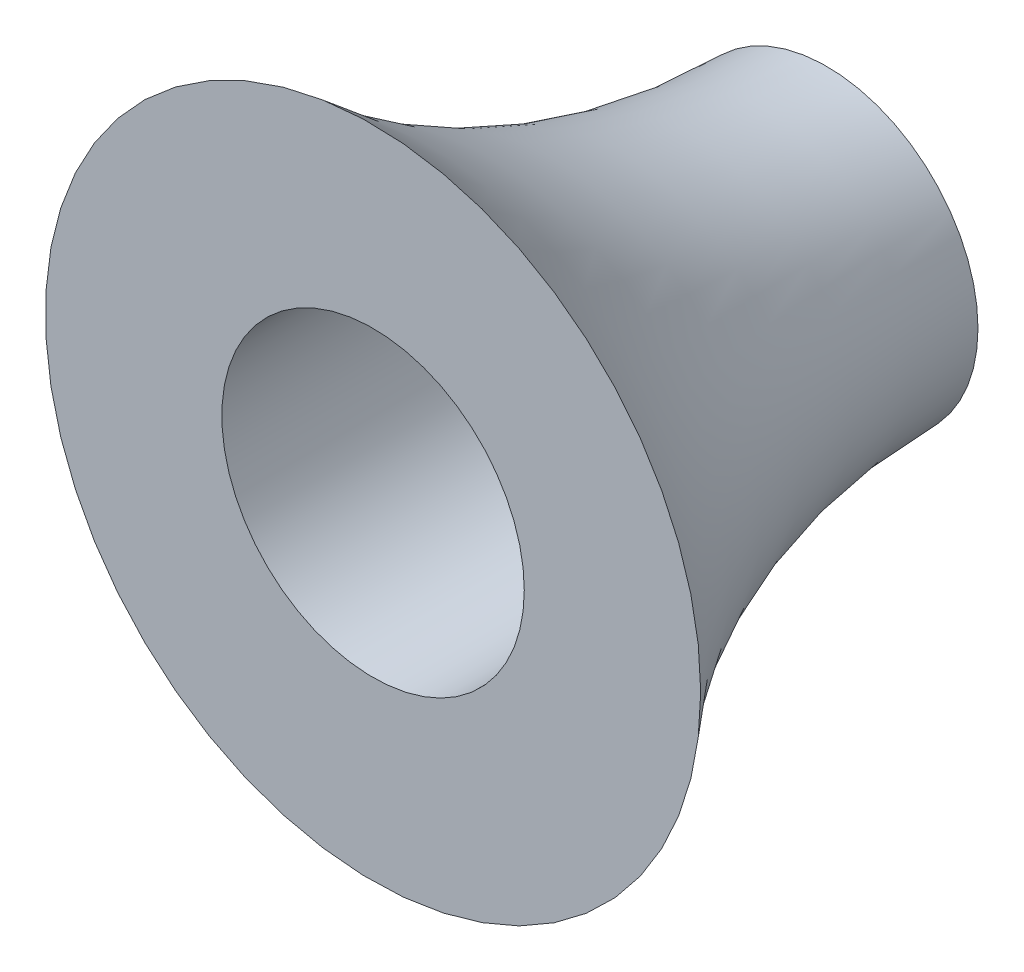
ISO-10303-21;
HEADER;
FILE_DESCRIPTION(('STEP AP214'),'2;1');
FILE_NAME('part.step','',(''),(''),'','','');
FILE_SCHEMA(('AUTOMOTIVE_DESIGN { 1 0 10303 214 1 1 1 1 }'));
ENDSEC;
DATA;
#1=APPLICATION_CONTEXT('core data for automotive mechanical design processes');
#2=APPLICATION_PROTOCOL_DEFINITION('international standard','automotive_design',2000,#1);
#3=PRODUCT_CONTEXT('',#1,'mechanical');
#4=PRODUCT('Part','Part','',(#3));
#5=PRODUCT_RELATED_PRODUCT_CATEGORY('part','',(#4));
#6=PRODUCT_DEFINITION_FORMATION('','',#4);
#7=PRODUCT_DEFINITION_CONTEXT('part definition',#1,'design');
#8=PRODUCT_DEFINITION('design','',#6,#7);
#9=PRODUCT_DEFINITION_SHAPE('','',#8);
#10=(LENGTH_UNIT() NAMED_UNIT(*) SI_UNIT(.MILLI.,.METRE.));
#11=(NAMED_UNIT(*) PLANE_ANGLE_UNIT() SI_UNIT($,.RADIAN.));
#12=(NAMED_UNIT(*) SI_UNIT($,.STERADIAN.) SOLID_ANGLE_UNIT());
#13=UNCERTAINTY_MEASURE_WITH_UNIT(LENGTH_MEASURE(1.E-05),#10,'distance_accuracy_value','');
#14=(GEOMETRIC_REPRESENTATION_CONTEXT(3) GLOBAL_UNCERTAINTY_ASSIGNED_CONTEXT((#13)) GLOBAL_UNIT_ASSIGNED_CONTEXT((#10,
#11,#12)) REPRESENTATION_CONTEXT('',''));
#15=CARTESIAN_POINT('',(0.,0.,0.));
#16=DIRECTION('',(0.,0.,1.));
#17=DIRECTION('',(1.,0.,0.));
#18=AXIS2_PLACEMENT_3D('',#15,#16,#17);
#19=CARTESIAN_POINT('',(-2.10805526532028,-5.08305526532028,-7.02));
#20=DIRECTION('',(0.,0.,1.));
#21=DIRECTION('',(1.,0.,0.));
#22=AXIS2_PLACEMENT_3D('',#19,#20,#21);
#23=PLANE('',#22);
#24=CARTESIAN_POINT('',(-1.225,-4.2,-7.02));
#25=DIRECTION('',(0.,0.,1.));
#26=DIRECTION('',(1.,0.,0.));
#27=AXIS2_PLACEMENT_3D('',#24,#25,#26);
#28=CIRCLE('',#27,0.299999999999998);
#29=CARTESIAN_POINT('',(-0.925000000000001,-4.2,-7.02));
#30=VERTEX_POINT('',#29);
#31=EDGE_CURVE('E19',#30,#30,#28,.T.);
#32=ORIENTED_EDGE('',*,*,#31,.F.);
#33=EDGE_LOOP('',(#32));
#34=FACE_BOUND('',#33,.T.);
#35=CARTESIAN_POINT('',(-1.225,-4.2,-7.01999999999981));
#36=DIRECTION('',(0.,0.,1.));
#37=DIRECTION('',(1.,0.,0.));
#38=AXIS2_PLACEMENT_3D('',#35,#36,#37);
#39=CIRCLE('',#38,0.650000000001197);
#40=CARTESIAN_POINT('',(-0.574999999998803,-4.2,-7.01999999999981));
#41=VERTEX_POINT('',#40);
#42=EDGE_CURVE('E23',#41,#41,#39,.F.);
#43=ORIENTED_EDGE('',*,*,#42,.F.);
#44=EDGE_LOOP('',(#43));
#45=FACE_BOUND('',#44,.T.);
#46=ADVANCED_FACE('F15',(#34,#45),#23,.T.);
#47=CARTESIAN_POINT('',(-1.225,-4.2,-7.92));
#48=DIRECTION('',(0.,0.,1.));
#49=DIRECTION('',(1.,0.,0.));
#50=AXIS2_PLACEMENT_3D('',#47,#48,#49);
#51=CYLINDRICAL_SURFACE('',#50,0.299999999999998);
#52=ORIENTED_EDGE('',*,*,#31,.T.);
#53=EDGE_LOOP('',(#52));
#54=FACE_BOUND('',#53,.T.);
#55=CARTESIAN_POINT('',(-1.225,-4.2,-7.92));
#56=DIRECTION('',(0.,0.,1.));
#57=DIRECTION('',(1.,0.,0.));
#58=AXIS2_PLACEMENT_3D('',#55,#56,#57);
#59=CIRCLE('',#58,0.299999999999998);
#60=CARTESIAN_POINT('',(-0.925000000000001,-4.2,-7.92));
#61=VERTEX_POINT('',#60);
#62=EDGE_CURVE('E10',#61,#61,#59,.T.);
#63=ORIENTED_EDGE('',*,*,#62,.F.);
#64=EDGE_LOOP('',(#63));
#65=FACE_BOUND('',#64,.T.);
#66=ADVANCED_FACE('F33',(#54,#65),#51,.F.);
#67=CARTESIAN_POINT('',(-1.225,-4.2,-7.92));
#68=DIRECTION('',(0.,0.,1.));
#69=DIRECTION('',(1.,0.,0.));
#70=AXIS2_PLACEMENT_3D('',#67,#68,#69);
#71=TOROIDAL_SURFACE('',#70,1.63214285713999,1.33214285713999);
#72=ORIENTED_EDGE('',*,*,#62,.T.);
#73=EDGE_LOOP('',(#72));
#74=FACE_BOUND('',#73,.T.);
#75=ORIENTED_EDGE('',*,*,#42,.T.);
#76=EDGE_LOOP('',(#75));
#77=FACE_BOUND('',#76,.T.);
#78=ADVANCED_FACE('F17',(#74,#77),#71,.F.);
#79=CLOSED_SHELL('',(#46,#66,#78));
#80=MANIFOLD_SOLID_BREP('B1',#79);
#81=ADVANCED_BREP_SHAPE_REPRESENTATION('',(#18,#80),#14);
#82=SHAPE_DEFINITION_REPRESENTATION(#9,#81);
ENDSEC;
END-ISO-10303-21;
